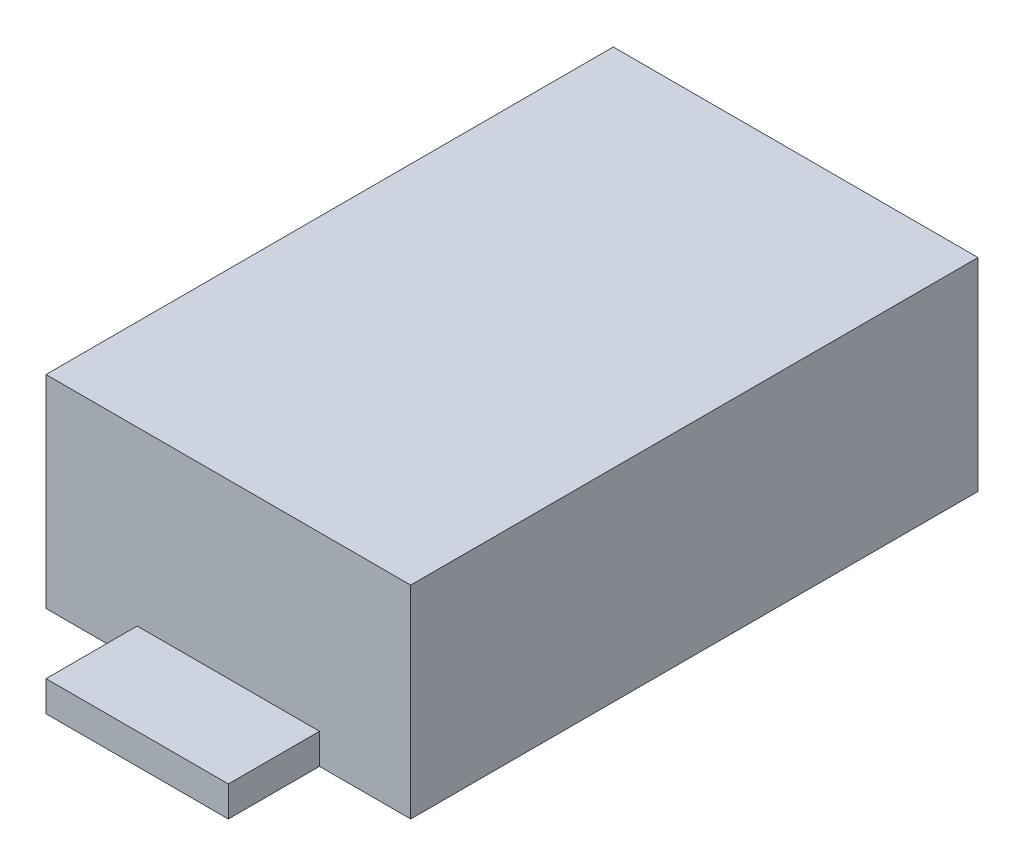
ISO-10303-21;
HEADER;
FILE_DESCRIPTION(('STEP AP214'),'2;1');
FILE_NAME('part.step','',(''),(''),'','','');
FILE_SCHEMA(('AUTOMOTIVE_DESIGN { 1 0 10303 214 1 1 1 1 }'));
ENDSEC;
DATA;
#1=APPLICATION_CONTEXT('core data for automotive mechanical design processes');
#2=APPLICATION_PROTOCOL_DEFINITION('international standard','automotive_design',2000,#1);
#3=PRODUCT_CONTEXT('',#1,'mechanical');
#4=PRODUCT('Part','Part','',(#3));
#5=PRODUCT_RELATED_PRODUCT_CATEGORY('part','',(#4));
#6=PRODUCT_DEFINITION_FORMATION('','',#4);
#7=PRODUCT_DEFINITION_CONTEXT('part definition',#1,'design');
#8=PRODUCT_DEFINITION('design','',#6,#7);
#9=PRODUCT_DEFINITION_SHAPE('','',#8);
#10=(LENGTH_UNIT() NAMED_UNIT(*) SI_UNIT(.MILLI.,.METRE.));
#11=(NAMED_UNIT(*) PLANE_ANGLE_UNIT() SI_UNIT($,.RADIAN.));
#12=(NAMED_UNIT(*) SI_UNIT($,.STERADIAN.) SOLID_ANGLE_UNIT());
#13=UNCERTAINTY_MEASURE_WITH_UNIT(LENGTH_MEASURE(1.E-05),#10,'distance_accuracy_value','');
#14=(GEOMETRIC_REPRESENTATION_CONTEXT(3) GLOBAL_UNCERTAINTY_ASSIGNED_CONTEXT((#13)) GLOBAL_UNIT_ASSIGNED_CONTEXT((#10,
#11,#12)) REPRESENTATION_CONTEXT('',''));
#15=CARTESIAN_POINT('',(0.,0.,0.));
#16=DIRECTION('',(0.,0.,1.));
#17=DIRECTION('',(1.,0.,0.));
#18=AXIS2_PLACEMENT_3D('',#15,#16,#17);
#19=CARTESIAN_POINT('',(-0.9,1.,1.4));
#20=DIRECTION('',(0.,0.,-1.));
#21=DIRECTION('',(-1.,0.,0.));
#22=AXIS2_PLACEMENT_3D('',#19,#20,#21);
#23=PLANE('',#22);
#24=DIRECTION('',(0.,-1.,0.));
#25=VECTOR('',#24,1.);
#26=CARTESIAN_POINT('',(-0.45,0.15,1.4));
#27=LINE('',#26,#25);
#28=CARTESIAN_POINT('',(-0.45,0.15,1.4));
#29=VERTEX_POINT('',#28);
#30=CARTESIAN_POINT('',(-0.45,0.,1.4));
#31=VERTEX_POINT('',#30);
#32=EDGE_CURVE('E155',#29,#31,#27,.T.);
#33=ORIENTED_EDGE('',*,*,#32,.F.);
#34=DIRECTION('',(1.,0.,0.));
#35=VECTOR('',#34,1.);
#36=CARTESIAN_POINT('',(-0.45,0.15,1.4));
#37=LINE('',#36,#35);
#38=CARTESIAN_POINT('',(0.45,0.15,1.4));
#39=VERTEX_POINT('',#38);
#40=EDGE_CURVE('E146',#29,#39,#37,.T.);
#41=ORIENTED_EDGE('',*,*,#40,.T.);
#42=DIRECTION('',(0.,-1.,0.));
#43=VECTOR('',#42,1.);
#44=CARTESIAN_POINT('',(0.45,0.15,1.4));
#45=LINE('',#44,#43);
#46=CARTESIAN_POINT('',(0.45,0.,1.4));
#47=VERTEX_POINT('',#46);
#48=EDGE_CURVE('E161',#39,#47,#45,.T.);
#49=ORIENTED_EDGE('',*,*,#48,.T.);
#50=DIRECTION('',(1.,0.,0.));
#51=VECTOR('',#50,1.);
#52=CARTESIAN_POINT('',(-0.9,0.,1.4));
#53=LINE('',#52,#51);
#54=CARTESIAN_POINT('',(0.9,0.,1.4));
#55=VERTEX_POINT('',#54);
#56=EDGE_CURVE('E206',#47,#55,#53,.T.);
#57=ORIENTED_EDGE('',*,*,#56,.T.);
#58=DIRECTION('',(0.,-1.,0.));
#59=VECTOR('',#58,1.);
#60=CARTESIAN_POINT('',(0.9,1.,1.4));
#61=LINE('',#60,#59);
#62=CARTESIAN_POINT('',(0.9,1.,1.4));
#63=VERTEX_POINT('',#62);
#64=EDGE_CURVE('E197',#63,#55,#61,.T.);
#65=ORIENTED_EDGE('',*,*,#64,.F.);
#66=DIRECTION('',(1.,0.,0.));
#67=VECTOR('',#66,1.);
#68=CARTESIAN_POINT('',(-0.9,1.,1.4));
#69=LINE('',#68,#67);
#70=CARTESIAN_POINT('',(-0.9,1.,1.4));
#71=VERTEX_POINT('',#70);
#72=EDGE_CURVE('E195',#71,#63,#69,.T.);
#73=ORIENTED_EDGE('',*,*,#72,.F.);
#74=DIRECTION('',(0.,-1.,0.));
#75=VECTOR('',#74,1.);
#76=CARTESIAN_POINT('',(-0.9,1.,1.4));
#77=LINE('',#76,#75);
#78=CARTESIAN_POINT('',(-0.9,0.,1.4));
#79=VERTEX_POINT('',#78);
#80=EDGE_CURVE('E211',#71,#79,#77,.T.);
#81=ORIENTED_EDGE('',*,*,#80,.T.);
#82=EDGE_CURVE('E191',#79,#31,#53,.T.);
#83=ORIENTED_EDGE('',*,*,#82,.T.);
#84=EDGE_LOOP('',(#33,#41,#49,#57,#65,#73,#81,#83));
#85=FACE_BOUND('',#84,.T.);
#86=ADVANCED_FACE('F36',(#85),#23,.F.);
#87=CARTESIAN_POINT('',(-0.9,1.,-1.4));
#88=DIRECTION('',(0.,0.,1.));
#89=DIRECTION('',(1.,0.,0.));
#90=AXIS2_PLACEMENT_3D('',#87,#88,#89);
#91=PLANE('',#90);
#92=DIRECTION('',(0.,-1.,0.));
#93=VECTOR('',#92,1.);
#94=CARTESIAN_POINT('',(0.45,0.15,-1.4));
#95=LINE('',#94,#93);
#96=CARTESIAN_POINT('',(0.45,0.15,-1.4));
#97=VERTEX_POINT('',#96);
#98=CARTESIAN_POINT('',(0.45,0.,-1.4));
#99=VERTEX_POINT('',#98);
#100=EDGE_CURVE('E182',#97,#99,#95,.T.);
#101=ORIENTED_EDGE('',*,*,#100,.F.);
#102=DIRECTION('',(1.,0.,0.));
#103=VECTOR('',#102,1.);
#104=CARTESIAN_POINT('',(-0.45,0.15,-1.4));
#105=LINE('',#104,#103);
#106=CARTESIAN_POINT('',(-0.45,0.15,-1.4));
#107=VERTEX_POINT('',#106);
#108=EDGE_CURVE('E166',#107,#97,#105,.T.);
#109=ORIENTED_EDGE('',*,*,#108,.F.);
#110=DIRECTION('',(0.,-1.,0.));
#111=VECTOR('',#110,1.);
#112=CARTESIAN_POINT('',(-0.45,0.15,-1.4));
#113=LINE('',#112,#111);
#114=CARTESIAN_POINT('',(-0.45,0.,-1.4));
#115=VERTEX_POINT('',#114);
#116=EDGE_CURVE('E184',#107,#115,#113,.T.);
#117=ORIENTED_EDGE('',*,*,#116,.T.);
#118=DIRECTION('',(-1.,0.,0.));
#119=VECTOR('',#118,1.);
#120=CARTESIAN_POINT('',(-0.9,0.,-1.4));
#121=LINE('',#120,#119);
#122=CARTESIAN_POINT('',(-0.9,0.,-1.4));
#123=VERTEX_POINT('',#122);
#124=EDGE_CURVE('E200',#115,#123,#121,.T.);
#125=ORIENTED_EDGE('',*,*,#124,.T.);
#126=DIRECTION('',(0.,-1.,0.));
#127=VECTOR('',#126,1.);
#128=CARTESIAN_POINT('',(-0.9,1.,-1.4));
#129=LINE('',#128,#127);
#130=CARTESIAN_POINT('',(-0.9,1.,-1.4));
#131=VERTEX_POINT('',#130);
#132=EDGE_CURVE('E44',#131,#123,#129,.T.);
#133=ORIENTED_EDGE('',*,*,#132,.F.);
#134=DIRECTION('',(-1.,0.,0.));
#135=VECTOR('',#134,1.);
#136=CARTESIAN_POINT('',(-0.9,1.,-1.4));
#137=LINE('',#136,#135);
#138=CARTESIAN_POINT('',(0.9,1.,-1.4));
#139=VERTEX_POINT('',#138);
#140=EDGE_CURVE('E190',#139,#131,#137,.T.);
#141=ORIENTED_EDGE('',*,*,#140,.F.);
#142=DIRECTION('',(0.,-1.,0.));
#143=VECTOR('',#142,1.);
#144=CARTESIAN_POINT('',(0.9,1.,-1.4));
#145=LINE('',#144,#143);
#146=CARTESIAN_POINT('',(0.9,0.,-1.4));
#147=VERTEX_POINT('',#146);
#148=EDGE_CURVE('E11',#139,#147,#145,.T.);
#149=ORIENTED_EDGE('',*,*,#148,.T.);
#150=EDGE_CURVE('E201',#147,#99,#121,.T.);
#151=ORIENTED_EDGE('',*,*,#150,.T.);
#152=EDGE_LOOP('',(#101,#109,#117,#125,#133,#141,#149,#151));
#153=FACE_BOUND('',#152,.T.);
#154=ADVANCED_FACE('F234',(#153),#91,.F.);
#155=CARTESIAN_POINT('',(0.9,1.,-1.4));
#156=DIRECTION('',(-1.,0.,0.));
#157=DIRECTION('',(0.,0.,1.));
#158=AXIS2_PLACEMENT_3D('',#155,#156,#157);
#159=PLANE('',#158);
#160=DIRECTION('',(0.,0.,-1.));
#161=VECTOR('',#160,1.);
#162=CARTESIAN_POINT('',(0.9,0.,-1.4));
#163=LINE('',#162,#161);
#164=EDGE_CURVE('E186',#55,#147,#163,.T.);
#165=ORIENTED_EDGE('',*,*,#164,.T.);
#166=ORIENTED_EDGE('',*,*,#148,.F.);
#167=DIRECTION('',(0.,0.,-1.));
#168=VECTOR('',#167,1.);
#169=CARTESIAN_POINT('',(0.9,1.,-1.4));
#170=LINE('',#169,#168);
#171=EDGE_CURVE('E187',#63,#139,#170,.T.);
#172=ORIENTED_EDGE('',*,*,#171,.F.);
#173=ORIENTED_EDGE('',*,*,#64,.T.);
#174=EDGE_LOOP('',(#165,#166,#172,#173));
#175=FACE_BOUND('',#174,.T.);
#176=ADVANCED_FACE('F38',(#175),#159,.F.);
#177=CARTESIAN_POINT('',(-0.9,1.,-1.4));
#178=DIRECTION('',(1.,0.,0.));
#179=DIRECTION('',(0.,0.,-1.));
#180=AXIS2_PLACEMENT_3D('',#177,#178,#179);
#181=PLANE('',#180);
#182=DIRECTION('',(0.,0.,1.));
#183=VECTOR('',#182,1.);
#184=CARTESIAN_POINT('',(-0.9,0.,-1.4));
#185=LINE('',#184,#183);
#186=EDGE_CURVE('E204',#123,#79,#185,.T.);
#187=ORIENTED_EDGE('',*,*,#186,.T.);
#188=ORIENTED_EDGE('',*,*,#80,.F.);
#189=DIRECTION('',(0.,0.,1.));
#190=VECTOR('',#189,1.);
#191=CARTESIAN_POINT('',(-0.9,1.,-1.4));
#192=LINE('',#191,#190);
#193=EDGE_CURVE('E193',#131,#71,#192,.T.);
#194=ORIENTED_EDGE('',*,*,#193,.F.);
#195=ORIENTED_EDGE('',*,*,#132,.T.);
#196=EDGE_LOOP('',(#187,#188,#194,#195));
#197=FACE_BOUND('',#196,.T.);
#198=ADVANCED_FACE('F218',(#197),#181,.F.);
#199=CARTESIAN_POINT('',(0.,1.,0.));
#200=DIRECTION('',(0.,1.,0.));
#201=DIRECTION('',(0.,0.,1.));
#202=AXIS2_PLACEMENT_3D('',#199,#200,#201);
#203=PLANE('',#202);
#204=ORIENTED_EDGE('',*,*,#171,.T.);
#205=ORIENTED_EDGE('',*,*,#140,.T.);
#206=ORIENTED_EDGE('',*,*,#193,.T.);
#207=ORIENTED_EDGE('',*,*,#72,.T.);
#208=EDGE_LOOP('',(#204,#205,#206,#207));
#209=FACE_BOUND('',#208,.T.);
#210=ADVANCED_FACE('F231',(#209),#203,.T.);
#211=CARTESIAN_POINT('',(0.,0.,0.));
#212=DIRECTION('',(0.,1.,0.));
#213=DIRECTION('',(0.,0.,1.));
#214=AXIS2_PLACEMENT_3D('',#211,#212,#213);
#215=PLANE('',#214);
#216=ORIENTED_EDGE('',*,*,#164,.F.);
#217=ORIENTED_EDGE('',*,*,#56,.F.);
#218=DIRECTION('',(0.,0.,1.));
#219=VECTOR('',#218,1.);
#220=CARTESIAN_POINT('',(0.45,0.,1.4));
#221=LINE('',#220,#219);
#222=CARTESIAN_POINT('',(0.45,0.,1.85));
#223=VERTEX_POINT('',#222);
#224=EDGE_CURVE('E51',#47,#223,#221,.T.);
#225=ORIENTED_EDGE('',*,*,#224,.T.);
#226=DIRECTION('',(-1.,0.,0.));
#227=VECTOR('',#226,1.);
#228=CARTESIAN_POINT('',(-0.45,0.,1.85));
#229=LINE('',#228,#227);
#230=CARTESIAN_POINT('',(-0.45,0.,1.85));
#231=VERTEX_POINT('',#230);
#232=EDGE_CURVE('E157',#223,#231,#229,.T.);
#233=ORIENTED_EDGE('',*,*,#232,.T.);
#234=DIRECTION('',(0.,0.,-1.));
#235=VECTOR('',#234,1.);
#236=CARTESIAN_POINT('',(-0.45,0.,1.4));
#237=LINE('',#236,#235);
#238=EDGE_CURVE('E132',#231,#31,#237,.T.);
#239=ORIENTED_EDGE('',*,*,#238,.T.);
#240=ORIENTED_EDGE('',*,*,#82,.F.);
#241=ORIENTED_EDGE('',*,*,#186,.F.);
#242=ORIENTED_EDGE('',*,*,#124,.F.);
#243=DIRECTION('',(0.,0.,1.));
#244=VECTOR('',#243,1.);
#245=CARTESIAN_POINT('',(-0.45,0.,-1.4));
#246=LINE('',#245,#244);
#247=CARTESIAN_POINT('',(-0.45,0.,-1.85));
#248=VERTEX_POINT('',#247);
#249=EDGE_CURVE('E59',#248,#115,#246,.T.);
#250=ORIENTED_EDGE('',*,*,#249,.F.);
#251=DIRECTION('',(-1.,0.,0.));
#252=VECTOR('',#251,1.);
#253=CARTESIAN_POINT('',(-0.45,0.,-1.85));
#254=LINE('',#253,#252);
#255=CARTESIAN_POINT('',(0.45,0.,-1.85));
#256=VERTEX_POINT('',#255);
#257=EDGE_CURVE('E167',#256,#248,#254,.T.);
#258=ORIENTED_EDGE('',*,*,#257,.F.);
#259=DIRECTION('',(0.,0.,-1.));
#260=VECTOR('',#259,1.);
#261=CARTESIAN_POINT('',(0.45,0.,-1.4));
#262=LINE('',#261,#260);
#263=EDGE_CURVE('E175',#99,#256,#262,.T.);
#264=ORIENTED_EDGE('',*,*,#263,.F.);
#265=ORIENTED_EDGE('',*,*,#150,.F.);
#266=EDGE_LOOP('',(#216,#217,#225,#233,#239,#240,#241,#242,#250,#258,#264,#265));
#267=FACE_BOUND('',#266,.T.);
#268=ADVANCED_FACE('F225',(#267),#215,.F.);
#269=CARTESIAN_POINT('',(-0.45,0.15,-1.4));
#270=DIRECTION('',(1.,0.,0.));
#271=DIRECTION('',(0.,0.,-1.));
#272=AXIS2_PLACEMENT_3D('',#269,#270,#271);
#273=PLANE('',#272);
#274=ORIENTED_EDGE('',*,*,#249,.T.);
#275=ORIENTED_EDGE('',*,*,#116,.F.);
#276=DIRECTION('',(0.,0.,1.));
#277=VECTOR('',#276,1.);
#278=CARTESIAN_POINT('',(-0.45,0.15,-1.4));
#279=LINE('',#278,#277);
#280=CARTESIAN_POINT('',(-0.45,0.15,-1.85));
#281=VERTEX_POINT('',#280);
#282=EDGE_CURVE('E164',#281,#107,#279,.T.);
#283=ORIENTED_EDGE('',*,*,#282,.F.);
#284=DIRECTION('',(0.,-1.,0.));
#285=VECTOR('',#284,1.);
#286=CARTESIAN_POINT('',(-0.45,0.15,-1.85));
#287=LINE('',#286,#285);
#288=EDGE_CURVE('E173',#281,#248,#287,.T.);
#289=ORIENTED_EDGE('',*,*,#288,.T.);
#290=EDGE_LOOP('',(#274,#275,#283,#289));
#291=FACE_BOUND('',#290,.T.);
#292=ADVANCED_FACE('F251',(#291),#273,.F.);
#293=CARTESIAN_POINT('',(0.45,0.15,-1.4));
#294=DIRECTION('',(-1.,0.,0.));
#295=DIRECTION('',(0.,0.,1.));
#296=AXIS2_PLACEMENT_3D('',#293,#294,#295);
#297=PLANE('',#296);
#298=ORIENTED_EDGE('',*,*,#263,.T.);
#299=DIRECTION('',(0.,-1.,0.));
#300=VECTOR('',#299,1.);
#301=CARTESIAN_POINT('',(0.45,0.15,-1.85));
#302=LINE('',#301,#300);
#303=CARTESIAN_POINT('',(0.45,0.15,-1.85));
#304=VERTEX_POINT('',#303);
#305=EDGE_CURVE('E179',#304,#256,#302,.T.);
#306=ORIENTED_EDGE('',*,*,#305,.F.);
#307=DIRECTION('',(0.,0.,-1.));
#308=VECTOR('',#307,1.);
#309=CARTESIAN_POINT('',(0.45,0.15,-1.4));
#310=LINE('',#309,#308);
#311=EDGE_CURVE('E169',#97,#304,#310,.T.);
#312=ORIENTED_EDGE('',*,*,#311,.F.);
#313=ORIENTED_EDGE('',*,*,#100,.T.);
#314=EDGE_LOOP('',(#298,#306,#312,#313));
#315=FACE_BOUND('',#314,.T.);
#316=ADVANCED_FACE('F241',(#315),#297,.F.);
#317=CARTESIAN_POINT('',(-0.45,0.15,-1.85));
#318=DIRECTION('',(0.,0.,1.));
#319=DIRECTION('',(1.,0.,0.));
#320=AXIS2_PLACEMENT_3D('',#317,#318,#319);
#321=PLANE('',#320);
#322=ORIENTED_EDGE('',*,*,#257,.T.);
#323=ORIENTED_EDGE('',*,*,#288,.F.);
#324=DIRECTION('',(-1.,0.,0.));
#325=VECTOR('',#324,1.);
#326=CARTESIAN_POINT('',(-0.45,0.15,-1.85));
#327=LINE('',#326,#325);
#328=EDGE_CURVE('E171',#304,#281,#327,.T.);
#329=ORIENTED_EDGE('',*,*,#328,.F.);
#330=ORIENTED_EDGE('',*,*,#305,.T.);
#331=EDGE_LOOP('',(#322,#323,#329,#330));
#332=FACE_BOUND('',#331,.T.);
#333=ADVANCED_FACE('F245',(#332),#321,.F.);
#334=CARTESIAN_POINT('',(0.,0.15,0.));
#335=DIRECTION('',(0.,-1.,0.));
#336=DIRECTION('',(0.,0.,-1.));
#337=AXIS2_PLACEMENT_3D('',#334,#335,#336);
#338=PLANE('',#337);
#339=ORIENTED_EDGE('',*,*,#282,.T.);
#340=ORIENTED_EDGE('',*,*,#108,.T.);
#341=ORIENTED_EDGE('',*,*,#311,.T.);
#342=ORIENTED_EDGE('',*,*,#328,.T.);
#343=EDGE_LOOP('',(#339,#340,#341,#342));
#344=FACE_BOUND('',#343,.T.);
#345=ADVANCED_FACE('F249',(#344),#338,.F.);
#346=CARTESIAN_POINT('',(-0.45,0.15,1.4));
#347=DIRECTION('',(-1.,0.,0.));
#348=DIRECTION('',(0.,0.,1.));
#349=AXIS2_PLACEMENT_3D('',#346,#347,#348);
#350=PLANE('',#349);
#351=ORIENTED_EDGE('',*,*,#238,.F.);
#352=DIRECTION('',(0.,-1.,0.));
#353=VECTOR('',#352,1.);
#354=CARTESIAN_POINT('',(-0.45,0.15,1.85));
#355=LINE('',#354,#353);
#356=CARTESIAN_POINT('',(-0.45,0.15,1.85));
#357=VERTEX_POINT('',#356);
#358=EDGE_CURVE('E126',#357,#231,#355,.T.);
#359=ORIENTED_EDGE('',*,*,#358,.F.);
#360=DIRECTION('',(0.,0.,-1.));
#361=VECTOR('',#360,1.);
#362=CARTESIAN_POINT('',(-0.45,0.15,1.4));
#363=LINE('',#362,#361);
#364=EDGE_CURVE('E129',#357,#29,#363,.T.);
#365=ORIENTED_EDGE('',*,*,#364,.T.);
#366=ORIENTED_EDGE('',*,*,#32,.T.);
#367=EDGE_LOOP('',(#351,#359,#365,#366));
#368=FACE_BOUND('',#367,.T.);
#369=ADVANCED_FACE('F128',(#368),#350,.T.);
#370=CARTESIAN_POINT('',(-0.45,0.15,1.85));
#371=DIRECTION('',(0.,0.,1.));
#372=DIRECTION('',(1.,0.,0.));
#373=AXIS2_PLACEMENT_3D('',#370,#371,#372);
#374=PLANE('',#373);
#375=ORIENTED_EDGE('',*,*,#232,.F.);
#376=DIRECTION('',(0.,-1.,0.));
#377=VECTOR('',#376,1.);
#378=CARTESIAN_POINT('',(0.45,0.15,1.85));
#379=LINE('',#378,#377);
#380=CARTESIAN_POINT('',(0.45,0.15,1.85));
#381=VERTEX_POINT('',#380);
#382=EDGE_CURVE('E137',#381,#223,#379,.T.);
#383=ORIENTED_EDGE('',*,*,#382,.F.);
#384=DIRECTION('',(-1.,0.,0.));
#385=VECTOR('',#384,1.);
#386=CARTESIAN_POINT('',(-0.45,0.15,1.85));
#387=LINE('',#386,#385);
#388=EDGE_CURVE('E143',#381,#357,#387,.T.);
#389=ORIENTED_EDGE('',*,*,#388,.T.);
#390=ORIENTED_EDGE('',*,*,#358,.T.);
#391=EDGE_LOOP('',(#375,#383,#389,#390));
#392=FACE_BOUND('',#391,.T.);
#393=ADVANCED_FACE('F149',(#392),#374,.T.);
#394=CARTESIAN_POINT('',(0.45,0.15,1.4));
#395=DIRECTION('',(1.,0.,0.));
#396=DIRECTION('',(0.,0.,-1.));
#397=AXIS2_PLACEMENT_3D('',#394,#395,#396);
#398=PLANE('',#397);
#399=ORIENTED_EDGE('',*,*,#224,.F.);
#400=ORIENTED_EDGE('',*,*,#48,.F.);
#401=DIRECTION('',(0.,0.,1.));
#402=VECTOR('',#401,1.);
#403=CARTESIAN_POINT('',(0.45,0.15,1.4));
#404=LINE('',#403,#402);
#405=EDGE_CURVE('E150',#39,#381,#404,.T.);
#406=ORIENTED_EDGE('',*,*,#405,.T.);
#407=ORIENTED_EDGE('',*,*,#382,.T.);
#408=EDGE_LOOP('',(#399,#400,#406,#407));
#409=FACE_BOUND('',#408,.T.);
#410=ADVANCED_FACE('F340',(#409),#398,.T.);
#411=CARTESIAN_POINT('',(0.,0.15,0.));
#412=DIRECTION('',(0.,-1.,0.));
#413=DIRECTION('',(0.,0.,1.));
#414=AXIS2_PLACEMENT_3D('',#411,#412,#413);
#415=PLANE('',#414);
#416=ORIENTED_EDGE('',*,*,#364,.F.);
#417=ORIENTED_EDGE('',*,*,#388,.F.);
#418=ORIENTED_EDGE('',*,*,#405,.F.);
#419=ORIENTED_EDGE('',*,*,#40,.F.);
#420=EDGE_LOOP('',(#416,#417,#418,#419));
#421=FACE_BOUND('',#420,.T.);
#422=ADVANCED_FACE('F141',(#421),#415,.F.);
#423=CLOSED_SHELL('',(#86,#154,#176,#198,#210,#268,#292,#316,#333,#345,#369,#393,#410,#422));
#424=MANIFOLD_SOLID_BREP('B2',#423);
#425=ADVANCED_BREP_SHAPE_REPRESENTATION('',(#18,#424),#14);
#426=SHAPE_DEFINITION_REPRESENTATION(#9,#425);
ENDSEC;
END-ISO-10303-21;
